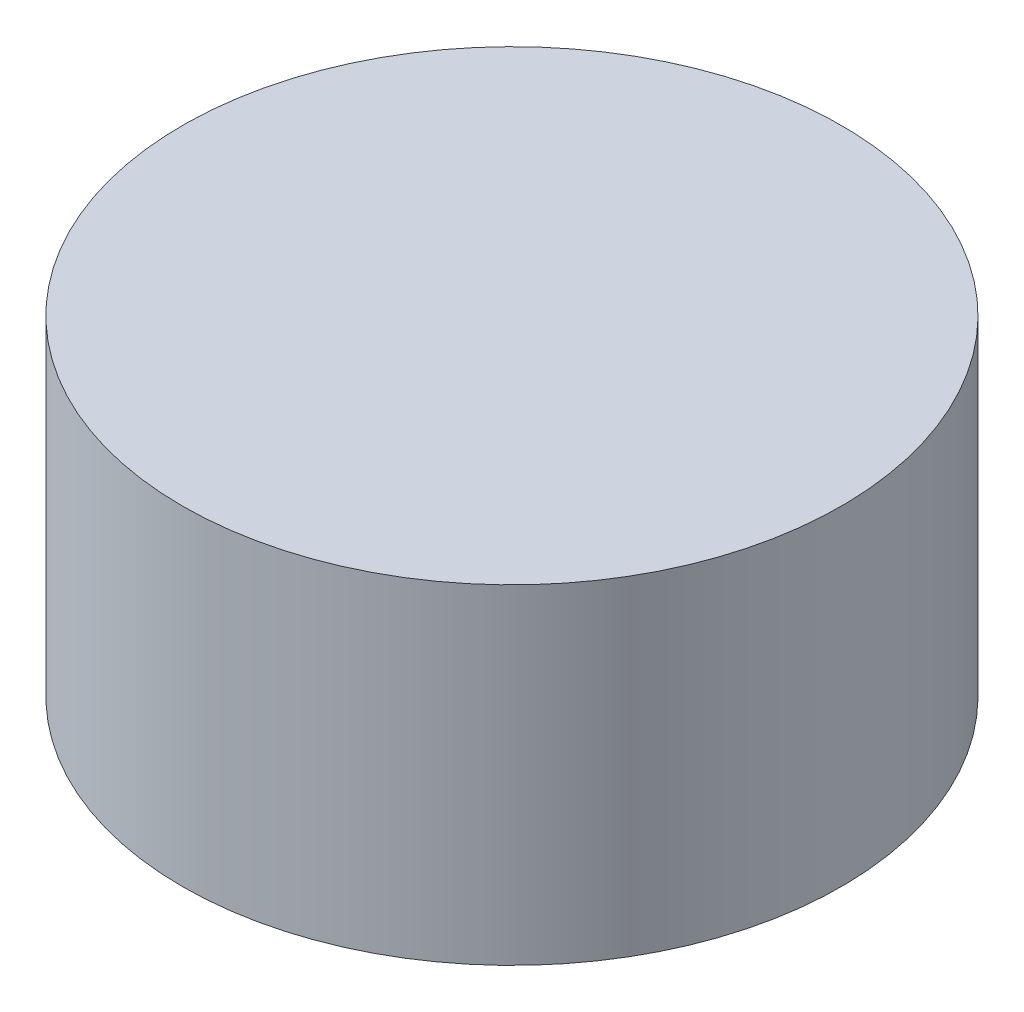
ISO-10303-21;
HEADER;
FILE_DESCRIPTION(('STEP AP214'),'2;1');
FILE_NAME('part.step','',(''),(''),'','','');
FILE_SCHEMA(('AUTOMOTIVE_DESIGN { 1 0 10303 214 1 1 1 1 }'));
ENDSEC;
DATA;
#1=APPLICATION_CONTEXT('core data for automotive mechanical design processes');
#2=APPLICATION_PROTOCOL_DEFINITION('international standard','automotive_design',2000,#1);
#3=PRODUCT_CONTEXT('',#1,'mechanical');
#4=PRODUCT('Part','Part','',(#3));
#5=PRODUCT_RELATED_PRODUCT_CATEGORY('part','',(#4));
#6=PRODUCT_DEFINITION_FORMATION('','',#4);
#7=PRODUCT_DEFINITION_CONTEXT('part definition',#1,'design');
#8=PRODUCT_DEFINITION('design','',#6,#7);
#9=PRODUCT_DEFINITION_SHAPE('','',#8);
#10=(LENGTH_UNIT() NAMED_UNIT(*) SI_UNIT(.MILLI.,.METRE.));
#11=(NAMED_UNIT(*) PLANE_ANGLE_UNIT() SI_UNIT($,.RADIAN.));
#12=(NAMED_UNIT(*) SI_UNIT($,.STERADIAN.) SOLID_ANGLE_UNIT());
#13=UNCERTAINTY_MEASURE_WITH_UNIT(LENGTH_MEASURE(1.E-05),#10,'distance_accuracy_value','');
#14=(GEOMETRIC_REPRESENTATION_CONTEXT(3) GLOBAL_UNCERTAINTY_ASSIGNED_CONTEXT((#13)) GLOBAL_UNIT_ASSIGNED_CONTEXT((#10,
#11,#12)) REPRESENTATION_CONTEXT('',''));
#15=CARTESIAN_POINT('',(0.,0.,0.));
#16=DIRECTION('',(0.,0.,1.));
#17=DIRECTION('',(1.,0.,0.));
#18=AXIS2_PLACEMENT_3D('',#15,#16,#17);
#19=CARTESIAN_POINT('',(0.,0.,0.));
#20=DIRECTION('',(0.,-1.,0.));
#21=DIRECTION('',(0.,0.,-1.));
#22=AXIS2_PLACEMENT_3D('',#19,#20,#21);
#23=PLANE('',#22);
#24=CARTESIAN_POINT('',(0.,0.,0.));
#25=DIRECTION('',(0.,1.,0.));
#26=DIRECTION('',(0.,0.,1.));
#27=AXIS2_PLACEMENT_3D('',#24,#25,#26);
#28=CIRCLE('',#27,7.);
#29=CARTESIAN_POINT('',(0.,0.,7.));
#30=VERTEX_POINT('',#29);
#31=EDGE_CURVE('E10',#30,#30,#28,.T.);
#32=ORIENTED_EDGE('',*,*,#31,.F.);
#33=EDGE_LOOP('',(#32));
#34=FACE_BOUND('',#33,.T.);
#35=ADVANCED_FACE('F32',(#34),#23,.T.);
#36=CARTESIAN_POINT('',(0.,7.,0.));
#37=DIRECTION('',(0.,1.,0.));
#38=DIRECTION('',(0.,0.,1.));
#39=AXIS2_PLACEMENT_3D('',#36,#37,#38);
#40=CYLINDRICAL_SURFACE('',#39,7.);
#41=ORIENTED_EDGE('',*,*,#31,.T.);
#42=EDGE_LOOP('',(#41));
#43=FACE_BOUND('',#42,.T.);
#44=CARTESIAN_POINT('',(0.,7.,0.));
#45=DIRECTION('',(0.,1.,0.));
#46=DIRECTION('',(0.,0.,1.));
#47=AXIS2_PLACEMENT_3D('',#44,#45,#46);
#48=CIRCLE('',#47,7.);
#49=CARTESIAN_POINT('',(0.,7.,7.));
#50=VERTEX_POINT('',#49);
#51=EDGE_CURVE('E38',#50,#50,#48,.T.);
#52=ORIENTED_EDGE('',*,*,#51,.F.);
#53=EDGE_LOOP('',(#52));
#54=FACE_BOUND('',#53,.T.);
#55=ADVANCED_FACE('F46',(#43,#54),#40,.T.);
#56=CARTESIAN_POINT('',(-7.,7.,0.));
#57=DIRECTION('',(0.,1.,0.));
#58=DIRECTION('',(0.,0.,1.));
#59=AXIS2_PLACEMENT_3D('',#56,#57,#58);
#60=PLANE('',#59);
#61=ORIENTED_EDGE('',*,*,#51,.T.);
#62=EDGE_LOOP('',(#61));
#63=FACE_BOUND('',#62,.T.);
#64=ADVANCED_FACE('F44',(#63),#60,.T.);
#65=CLOSED_SHELL('',(#35,#55,#64));
#66=MANIFOLD_SOLID_BREP('B2',#65);
#67=ADVANCED_BREP_SHAPE_REPRESENTATION('',(#18,#66),#14);
#68=SHAPE_DEFINITION_REPRESENTATION(#9,#67);
ENDSEC;
END-ISO-10303-21;
